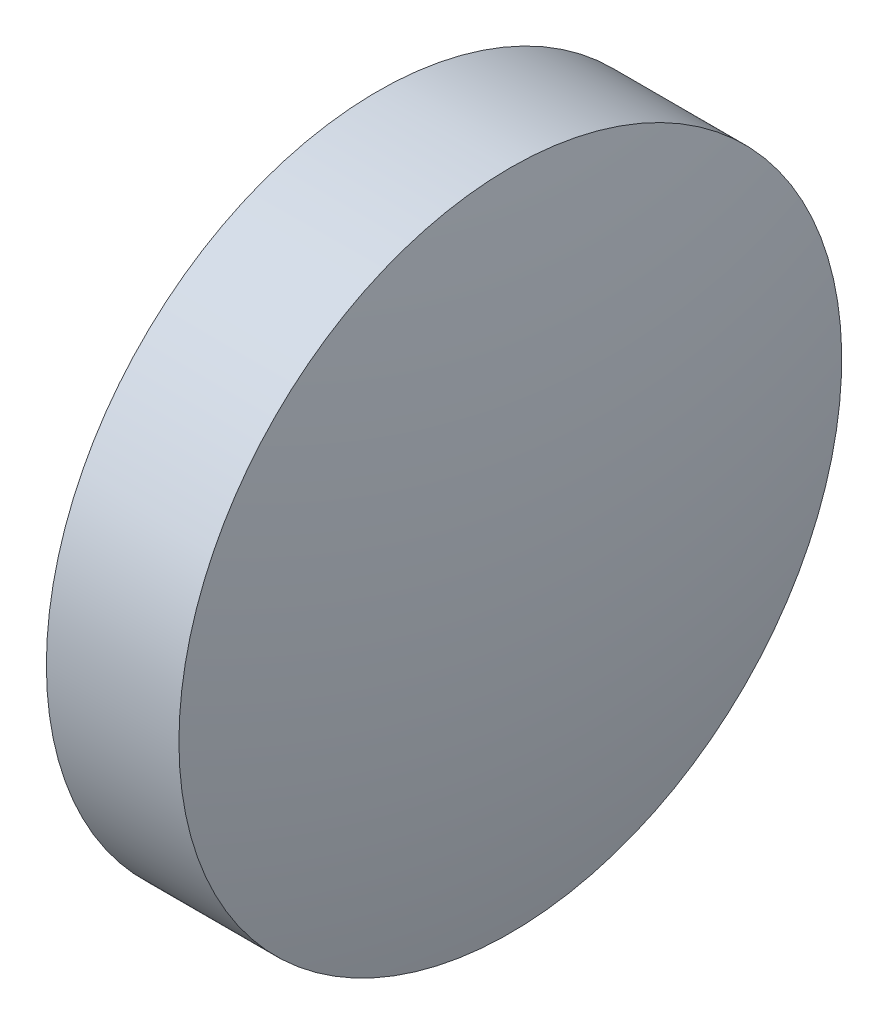
ISO-10303-21;
HEADER;
FILE_DESCRIPTION(('STEP AP214'),'2;1');
FILE_NAME('part.step','',(''),(''),'','','');
FILE_SCHEMA(('AUTOMOTIVE_DESIGN { 1 0 10303 214 1 1 1 1 }'));
ENDSEC;
DATA;
#1=APPLICATION_CONTEXT('core data for automotive mechanical design processes');
#2=APPLICATION_PROTOCOL_DEFINITION('international standard','automotive_design',2000,#1);
#3=PRODUCT_CONTEXT('',#1,'mechanical');
#4=PRODUCT('Part','Part','',(#3));
#5=PRODUCT_RELATED_PRODUCT_CATEGORY('part','',(#4));
#6=PRODUCT_DEFINITION_FORMATION('','',#4);
#7=PRODUCT_DEFINITION_CONTEXT('part definition',#1,'design');
#8=PRODUCT_DEFINITION('design','',#6,#7);
#9=PRODUCT_DEFINITION_SHAPE('','',#8);
#10=(LENGTH_UNIT() NAMED_UNIT(*) SI_UNIT(.MILLI.,.METRE.));
#11=(NAMED_UNIT(*) PLANE_ANGLE_UNIT() SI_UNIT($,.RADIAN.));
#12=(NAMED_UNIT(*) SI_UNIT($,.STERADIAN.) SOLID_ANGLE_UNIT());
#13=UNCERTAINTY_MEASURE_WITH_UNIT(LENGTH_MEASURE(1.E-05),#10,'distance_accuracy_value','');
#14=(GEOMETRIC_REPRESENTATION_CONTEXT(3) GLOBAL_UNCERTAINTY_ASSIGNED_CONTEXT((#13)) GLOBAL_UNIT_ASSIGNED_CONTEXT((#10,
#11,#12)) REPRESENTATION_CONTEXT('',''));
#15=CARTESIAN_POINT('',(0.,0.,0.));
#16=DIRECTION('',(0.,0.,1.));
#17=DIRECTION('',(1.,0.,0.));
#18=AXIS2_PLACEMENT_3D('',#15,#16,#17);
#19=CARTESIAN_POINT('',(414.924128248551,64.0026486919661,0.));
#20=DIRECTION('',(-1.,0.,0.));
#21=DIRECTION('',(0.,1.,0.));
#22=AXIS2_PLACEMENT_3D('',#19,#20,#21);
#23=SPHERICAL_SURFACE('',#22,22.6014285714286);
#24=CARTESIAN_POINT('',(436.96555681998,64.0026486919662,0.));
#25=DIRECTION('',(-1.,0.,0.));
#26=DIRECTION('',(0.,0.,1.));
#27=AXIS2_PLACEMENT_3D('',#24,#25,#26);
#28=CIRCLE('',#27,5.);
#29=CARTESIAN_POINT('',(436.96555681998,64.0026486919662,5.));
#30=VERTEX_POINT('',#29);
#31=EDGE_CURVE('E10',#30,#30,#28,.T.);
#32=ORIENTED_EDGE('',*,*,#31,.F.);
#33=EDGE_LOOP('',(#32));
#34=FACE_BOUND('',#33,.T.);
#35=ADVANCED_FACE('F35',(#34),#23,.T.);
#36=CARTESIAN_POINT('',(433.823327127536,64.0026486919662,0.));
#37=DIRECTION('',(-1.,0.,0.));
#38=DIRECTION('',(0.,0.,1.));
#39=AXIS2_PLACEMENT_3D('',#36,#37,#38);
#40=CYLINDRICAL_SURFACE('',#39,5.);
#41=CARTESIAN_POINT('',(434.96555681998,64.0026486919662,0.));
#42=DIRECTION('',(-1.,0.,0.));
#43=DIRECTION('',(0.,0.,1.));
#44=AXIS2_PLACEMENT_3D('',#41,#42,#43);
#45=CIRCLE('',#44,5.);
#46=CARTESIAN_POINT('',(434.96555681998,64.0026486919662,5.));
#47=VERTEX_POINT('',#46);
#48=EDGE_CURVE('E41',#47,#47,#45,.T.);
#49=ORIENTED_EDGE('',*,*,#48,.F.);
#50=EDGE_LOOP('',(#49));
#51=FACE_BOUND('',#50,.T.);
#52=ORIENTED_EDGE('',*,*,#31,.T.);
#53=EDGE_LOOP('',(#52));
#54=FACE_BOUND('',#53,.T.);
#55=ADVANCED_FACE('F49',(#51,#54),#40,.T.);
#56=CARTESIAN_POINT('',(434.96555681998,64.0026486919662,0.));
#57=DIRECTION('',(1.,0.,0.));
#58=DIRECTION('',(0.,0.,-1.));
#59=AXIS2_PLACEMENT_3D('',#56,#57,#58);
#60=PLANE('',#59);
#61=ORIENTED_EDGE('',*,*,#48,.T.);
#62=EDGE_LOOP('',(#61));
#63=FACE_BOUND('',#62,.T.);
#64=ADVANCED_FACE('F47',(#63),#60,.F.);
#65=CLOSED_SHELL('',(#35,#55,#64));
#66=MANIFOLD_SOLID_BREP('B2',#65);
#67=ADVANCED_BREP_SHAPE_REPRESENTATION('',(#18,#66),#14);
#68=SHAPE_DEFINITION_REPRESENTATION(#9,#67);
ENDSEC;
END-ISO-10303-21;
